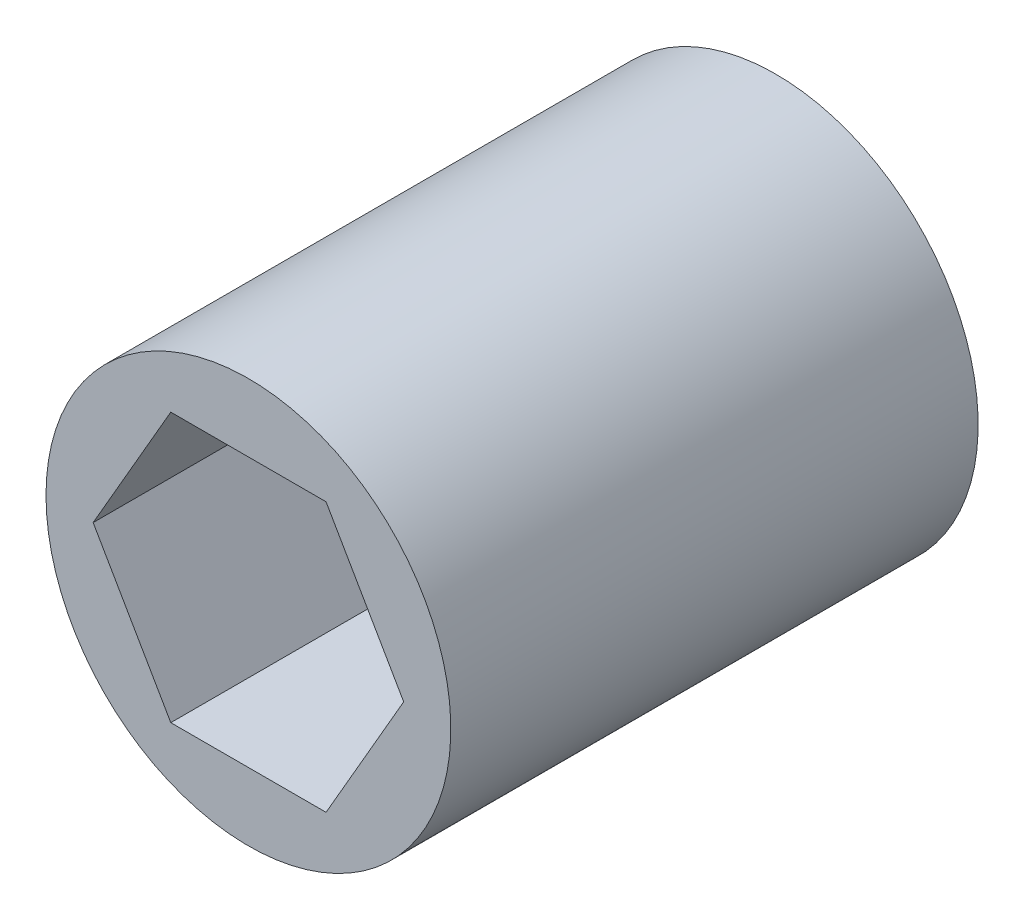
ISO-10303-21;
HEADER;
FILE_DESCRIPTION(('STEP AP214'),'2;1');
FILE_NAME('part.step','',(''),(''),'','','');
FILE_SCHEMA(('AUTOMOTIVE_DESIGN { 1 0 10303 214 1 1 1 1 }'));
ENDSEC;
DATA;
#1=APPLICATION_CONTEXT('core data for automotive mechanical design processes');
#2=APPLICATION_PROTOCOL_DEFINITION('international standard','automotive_design',2000,#1);
#3=PRODUCT_CONTEXT('',#1,'mechanical');
#4=PRODUCT('Part','Part','',(#3));
#5=PRODUCT_RELATED_PRODUCT_CATEGORY('part','',(#4));
#6=PRODUCT_DEFINITION_FORMATION('','',#4);
#7=PRODUCT_DEFINITION_CONTEXT('part definition',#1,'design');
#8=PRODUCT_DEFINITION('design','',#6,#7);
#9=PRODUCT_DEFINITION_SHAPE('','',#8);
#10=(LENGTH_UNIT() NAMED_UNIT(*) SI_UNIT(.MILLI.,.METRE.));
#11=(NAMED_UNIT(*) PLANE_ANGLE_UNIT() SI_UNIT($,.RADIAN.));
#12=(NAMED_UNIT(*) SI_UNIT($,.STERADIAN.) SOLID_ANGLE_UNIT());
#13=UNCERTAINTY_MEASURE_WITH_UNIT(LENGTH_MEASURE(1.E-05),#10,'distance_accuracy_value','');
#14=(GEOMETRIC_REPRESENTATION_CONTEXT(3) GLOBAL_UNCERTAINTY_ASSIGNED_CONTEXT((#13)) GLOBAL_UNIT_ASSIGNED_CONTEXT((#10,
#11,#12)) REPRESENTATION_CONTEXT('',''));
#15=CARTESIAN_POINT('',(0.,0.,0.));
#16=DIRECTION('',(0.,0.,1.));
#17=DIRECTION('',(1.,0.,0.));
#18=AXIS2_PLACEMENT_3D('',#15,#16,#17);
#19=CARTESIAN_POINT('',(-7.47899538708241,0.,12.7));
#20=DIRECTION('',(0.866025403784439,0.5,0.));
#21=DIRECTION('',(-0.5,0.866025403784439,0.));
#22=AXIS2_PLACEMENT_3D('',#19,#20,#21);
#23=PLANE('',#22);
#24=DIRECTION('',(-0.5,0.866025403784438,0.));
#25=VECTOR('',#24,1.);
#26=CARTESIAN_POINT('',(-3.73949769354121,-6.477,12.7));
#27=LINE('',#26,#25);
#28=CARTESIAN_POINT('',(-3.73949769354121,-6.477,12.7));
#29=VERTEX_POINT('',#28);
#30=CARTESIAN_POINT('',(-7.47899538708241,0.,12.7));
#31=VERTEX_POINT('',#30);
#32=EDGE_CURVE('E85',#29,#31,#27,.T.);
#33=ORIENTED_EDGE('',*,*,#32,.F.);
#34=DIRECTION('',(0.,0.,1.));
#35=VECTOR('',#34,1.);
#36=CARTESIAN_POINT('',(-3.73949769354121,-6.477,12.7));
#37=LINE('',#36,#35);
#38=CARTESIAN_POINT('',(-3.73949769354121,-6.477,-12.7));
#39=VERTEX_POINT('',#38);
#40=EDGE_CURVE('E77',#39,#29,#37,.T.);
#41=ORIENTED_EDGE('',*,*,#40,.F.);
#42=DIRECTION('',(-0.5,0.866025403784439,0.));
#43=VECTOR('',#42,1.);
#44=CARTESIAN_POINT('',(-3.73949769354121,-6.477,-12.7));
#45=LINE('',#44,#43);
#46=CARTESIAN_POINT('',(-7.47899538708241,0.,-12.7));
#47=VERTEX_POINT('',#46);
#48=EDGE_CURVE('E117',#39,#47,#45,.T.);
#49=ORIENTED_EDGE('',*,*,#48,.T.);
#50=DIRECTION('',(0.,0.,1.));
#51=VECTOR('',#50,1.);
#52=CARTESIAN_POINT('',(-7.47899538708241,0.,12.7));
#53=LINE('',#52,#51);
#54=EDGE_CURVE('E102',#31,#47,#53,.F.);
#55=ORIENTED_EDGE('',*,*,#54,.F.);
#56=EDGE_LOOP('',(#33,#41,#49,#55));
#57=FACE_BOUND('',#56,.T.);
#58=ADVANCED_FACE('F18',(#57),#23,.T.);
#59=CARTESIAN_POINT('',(-3.73949769354121,6.477,12.7));
#60=DIRECTION('',(0.866025403784439,-0.5,0.));
#61=DIRECTION('',(0.5,0.866025403784439,0.));
#62=AXIS2_PLACEMENT_3D('',#59,#60,#61);
#63=PLANE('',#62);
#64=DIRECTION('',(0.5,0.866025403784439,0.));
#65=VECTOR('',#64,1.);
#66=CARTESIAN_POINT('',(-7.47899538708242,0.,12.7));
#67=LINE('',#66,#65);
#68=CARTESIAN_POINT('',(-3.73949769354121,6.477,12.7));
#69=VERTEX_POINT('',#68);
#70=EDGE_CURVE('E110',#31,#69,#67,.T.);
#71=ORIENTED_EDGE('',*,*,#70,.F.);
#72=ORIENTED_EDGE('',*,*,#54,.T.);
#73=DIRECTION('',(0.5,0.866025403784439,0.));
#74=VECTOR('',#73,1.);
#75=CARTESIAN_POINT('',(-7.47899538708241,0.,-12.7));
#76=LINE('',#75,#74);
#77=CARTESIAN_POINT('',(-3.73949769354121,6.477,-12.7));
#78=VERTEX_POINT('',#77);
#79=EDGE_CURVE('E108',#47,#78,#76,.T.);
#80=ORIENTED_EDGE('',*,*,#79,.T.);
#81=DIRECTION('',(0.,0.,1.));
#82=VECTOR('',#81,1.);
#83=CARTESIAN_POINT('',(-3.73949769354121,6.477,12.7));
#84=LINE('',#83,#82);
#85=EDGE_CURVE('E99',#69,#78,#84,.F.);
#86=ORIENTED_EDGE('',*,*,#85,.F.);
#87=EDGE_LOOP('',(#71,#72,#80,#86));
#88=FACE_BOUND('',#87,.T.);
#89=ADVANCED_FACE('F107',(#88),#63,.T.);
#90=CARTESIAN_POINT('',(3.7394976935412,6.477,12.7));
#91=DIRECTION('',(0.,-1.,0.));
#92=DIRECTION('',(1.,0.,0.));
#93=AXIS2_PLACEMENT_3D('',#90,#91,#92);
#94=PLANE('',#93);
#95=DIRECTION('',(1.,0.,0.));
#96=VECTOR('',#95,1.);
#97=CARTESIAN_POINT('',(0.,6.477,12.7));
#98=LINE('',#97,#96);
#99=CARTESIAN_POINT('',(3.7394976935412,6.477,12.7));
#100=VERTEX_POINT('',#99);
#101=EDGE_CURVE('E127',#69,#100,#98,.T.);
#102=ORIENTED_EDGE('',*,*,#101,.F.);
#103=ORIENTED_EDGE('',*,*,#85,.T.);
#104=DIRECTION('',(1.,0.,0.));
#105=VECTOR('',#104,1.);
#106=CARTESIAN_POINT('',(0.,6.477,-12.7));
#107=LINE('',#106,#105);
#108=CARTESIAN_POINT('',(3.7394976935412,6.477,-12.7));
#109=VERTEX_POINT('',#108);
#110=EDGE_CURVE('E119',#78,#109,#107,.T.);
#111=ORIENTED_EDGE('',*,*,#110,.T.);
#112=DIRECTION('',(0.,0.,1.));
#113=VECTOR('',#112,1.);
#114=CARTESIAN_POINT('',(3.7394976935412,6.47700000000001,12.7));
#115=LINE('',#114,#113);
#116=EDGE_CURVE('E96',#100,#109,#115,.F.);
#117=ORIENTED_EDGE('',*,*,#116,.F.);
#118=EDGE_LOOP('',(#102,#103,#111,#117));
#119=FACE_BOUND('',#118,.T.);
#120=ADVANCED_FACE('F136',(#119),#94,.T.);
#121=CARTESIAN_POINT('',(7.47899538708241,0.,12.7));
#122=DIRECTION('',(-0.866025403784439,-0.5,0.));
#123=DIRECTION('',(0.5,-0.866025403784439,0.));
#124=AXIS2_PLACEMENT_3D('',#121,#122,#123);
#125=PLANE('',#124);
#126=DIRECTION('',(0.5,-0.866025403784438,0.));
#127=VECTOR('',#126,1.);
#128=CARTESIAN_POINT('',(3.7394976935412,6.477,12.7));
#129=LINE('',#128,#127);
#130=CARTESIAN_POINT('',(7.47899538708242,0.,12.7));
#131=VERTEX_POINT('',#130);
#132=EDGE_CURVE('E90',#100,#131,#129,.T.);
#133=ORIENTED_EDGE('',*,*,#132,.F.);
#134=ORIENTED_EDGE('',*,*,#116,.T.);
#135=DIRECTION('',(0.5,-0.866025403784438,0.));
#136=VECTOR('',#135,1.);
#137=CARTESIAN_POINT('',(3.7394976935412,6.477,-12.7));
#138=LINE('',#137,#136);
#139=CARTESIAN_POINT('',(7.47899538708241,0.,-12.7));
#140=VERTEX_POINT('',#139);
#141=EDGE_CURVE('E121',#109,#140,#138,.T.);
#142=ORIENTED_EDGE('',*,*,#141,.T.);
#143=DIRECTION('',(0.,0.,1.));
#144=VECTOR('',#143,1.);
#145=CARTESIAN_POINT('',(7.47899538708242,0.,12.7));
#146=LINE('',#145,#144);
#147=EDGE_CURVE('E66',#131,#140,#146,.F.);
#148=ORIENTED_EDGE('',*,*,#147,.F.);
#149=EDGE_LOOP('',(#133,#134,#142,#148));
#150=FACE_BOUND('',#149,.T.);
#151=ADVANCED_FACE('F133',(#150),#125,.T.);
#152=CARTESIAN_POINT('',(3.73949769354121,-6.477,12.7));
#153=DIRECTION('',(-0.866025403784439,0.5,0.));
#154=DIRECTION('',(-0.5,-0.866025403784439,0.));
#155=AXIS2_PLACEMENT_3D('',#152,#153,#154);
#156=PLANE('',#155);
#157=DIRECTION('',(-0.5,-0.866025403784439,0.));
#158=VECTOR('',#157,1.);
#159=CARTESIAN_POINT('',(7.47899538708241,0.,12.7));
#160=LINE('',#159,#158);
#161=CARTESIAN_POINT('',(3.73949769354121,-6.477,12.7));
#162=VERTEX_POINT('',#161);
#163=EDGE_CURVE('E72',#131,#162,#160,.T.);
#164=ORIENTED_EDGE('',*,*,#163,.F.);
#165=ORIENTED_EDGE('',*,*,#147,.T.);
#166=DIRECTION('',(-0.5,-0.866025403784439,0.));
#167=VECTOR('',#166,1.);
#168=CARTESIAN_POINT('',(7.47899538708241,0.,-12.7));
#169=LINE('',#168,#167);
#170=CARTESIAN_POINT('',(3.73949769354121,-6.477,-12.7));
#171=VERTEX_POINT('',#170);
#172=EDGE_CURVE('E34',#140,#171,#169,.T.);
#173=ORIENTED_EDGE('',*,*,#172,.T.);
#174=DIRECTION('',(0.,0.,1.));
#175=VECTOR('',#174,1.);
#176=CARTESIAN_POINT('',(3.73949769354121,-6.477,12.7));
#177=LINE('',#176,#175);
#178=EDGE_CURVE('E68',#162,#171,#177,.F.);
#179=ORIENTED_EDGE('',*,*,#178,.F.);
#180=EDGE_LOOP('',(#164,#165,#173,#179));
#181=FACE_BOUND('',#180,.T.);
#182=ADVANCED_FACE('F70',(#181),#156,.T.);
#183=CARTESIAN_POINT('',(-3.73949769354121,-6.477,12.7));
#184=DIRECTION('',(0.,1.,0.));
#185=DIRECTION('',(0.,0.,1.));
#186=AXIS2_PLACEMENT_3D('',#183,#184,#185);
#187=PLANE('',#186);
#188=DIRECTION('',(1.,0.,0.));
#189=VECTOR('',#188,1.);
#190=CARTESIAN_POINT('',(0.,-6.477,12.7));
#191=LINE('',#190,#189);
#192=EDGE_CURVE('E80',#162,#29,#191,.F.);
#193=ORIENTED_EDGE('',*,*,#192,.F.);
#194=ORIENTED_EDGE('',*,*,#178,.T.);
#195=DIRECTION('',(1.,0.,0.));
#196=VECTOR('',#195,1.);
#197=CARTESIAN_POINT('',(0.,-6.477,-12.7));
#198=LINE('',#197,#196);
#199=EDGE_CURVE('E129',#171,#39,#198,.F.);
#200=ORIENTED_EDGE('',*,*,#199,.T.);
#201=ORIENTED_EDGE('',*,*,#40,.T.);
#202=EDGE_LOOP('',(#193,#194,#200,#201));
#203=FACE_BOUND('',#202,.T.);
#204=ADVANCED_FACE('F81',(#203),#187,.T.);
#205=CARTESIAN_POINT('',(0.,0.,12.7));
#206=DIRECTION('',(0.,0.,1.));
#207=DIRECTION('',(1.,0.,0.));
#208=AXIS2_PLACEMENT_3D('',#205,#206,#207);
#209=PLANE('',#208);
#210=ORIENTED_EDGE('',*,*,#101,.T.);
#211=ORIENTED_EDGE('',*,*,#132,.T.);
#212=ORIENTED_EDGE('',*,*,#163,.T.);
#213=ORIENTED_EDGE('',*,*,#192,.T.);
#214=ORIENTED_EDGE('',*,*,#32,.T.);
#215=ORIENTED_EDGE('',*,*,#70,.T.);
#216=EDGE_LOOP('',(#210,#211,#212,#213,#214,#215));
#217=FACE_BOUND('',#216,.T.);
#218=CARTESIAN_POINT('',(0.,0.,12.7));
#219=DIRECTION('',(0.,0.,-1.));
#220=DIRECTION('',(-1.,0.,0.));
#221=AXIS2_PLACEMENT_3D('',#218,#219,#220);
#222=CIRCLE('',#221,9.75);
#223=CARTESIAN_POINT('',(-9.75,0.,12.7));
#224=VERTEX_POINT('',#223);
#225=EDGE_CURVE('E21',#224,#224,#222,.T.);
#226=ORIENTED_EDGE('',*,*,#225,.F.);
#227=EDGE_LOOP('',(#226));
#228=FACE_BOUND('',#227,.T.);
#229=ADVANCED_FACE('F88',(#217,#228),#209,.T.);
#230=CARTESIAN_POINT('',(0.,0.,-12.7));
#231=DIRECTION('',(0.,0.,1.));
#232=DIRECTION('',(1.,0.,0.));
#233=AXIS2_PLACEMENT_3D('',#230,#231,#232);
#234=PLANE('',#233);
#235=ORIENTED_EDGE('',*,*,#172,.F.);
#236=ORIENTED_EDGE('',*,*,#141,.F.);
#237=ORIENTED_EDGE('',*,*,#110,.F.);
#238=ORIENTED_EDGE('',*,*,#79,.F.);
#239=ORIENTED_EDGE('',*,*,#48,.F.);
#240=ORIENTED_EDGE('',*,*,#199,.F.);
#241=EDGE_LOOP('',(#235,#236,#237,#238,#239,#240));
#242=FACE_BOUND('',#241,.T.);
#243=CARTESIAN_POINT('',(0.,0.,-12.7));
#244=DIRECTION('',(0.,0.,-1.));
#245=DIRECTION('',(-1.,0.,0.));
#246=AXIS2_PLACEMENT_3D('',#243,#244,#245);
#247=CIRCLE('',#246,9.75);
#248=CARTESIAN_POINT('',(-9.75,0.,-12.7));
#249=VERTEX_POINT('',#248);
#250=EDGE_CURVE('E11',#249,#249,#247,.F.);
#251=ORIENTED_EDGE('',*,*,#250,.F.);
#252=EDGE_LOOP('',(#251));
#253=FACE_BOUND('',#252,.T.);
#254=ADVANCED_FACE('F115',(#242,#253),#234,.F.);
#255=CARTESIAN_POINT('',(0.,0.,12.7));
#256=DIRECTION('',(0.,0.,-1.));
#257=DIRECTION('',(-1.,0.,0.));
#258=AXIS2_PLACEMENT_3D('',#255,#256,#257);
#259=CYLINDRICAL_SURFACE('',#258,9.75);
#260=ORIENTED_EDGE('',*,*,#250,.T.);
#261=EDGE_LOOP('',(#260));
#262=FACE_BOUND('',#261,.T.);
#263=ORIENTED_EDGE('',*,*,#225,.T.);
#264=EDGE_LOOP('',(#263));
#265=FACE_BOUND('',#264,.T.);
#266=ADVANCED_FACE('F145',(#262,#265),#259,.T.);
#267=CLOSED_SHELL('',(#58,#89,#120,#151,#182,#204,#229,#254,#266));
#268=MANIFOLD_SOLID_BREP('B1',#267);
#269=ADVANCED_BREP_SHAPE_REPRESENTATION('',(#18,#268),#14);
#270=SHAPE_DEFINITION_REPRESENTATION(#9,#269);
ENDSEC;
END-ISO-10303-21;
